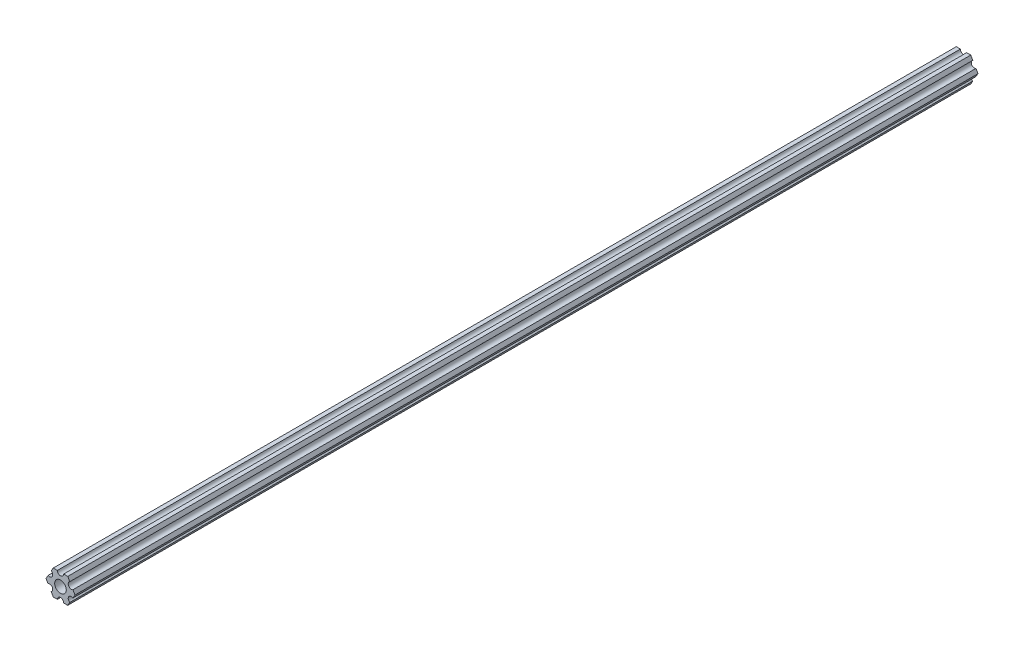
ISO-10303-21;
HEADER;
FILE_DESCRIPTION(('STEP AP214'),'2;1');
FILE_NAME('part.step','',(''),(''),'','','');
FILE_SCHEMA(('AUTOMOTIVE_DESIGN { 1 0 10303 214 1 1 1 1 }'));
ENDSEC;
DATA;
#1=APPLICATION_CONTEXT('core data for automotive mechanical design processes');
#2=APPLICATION_PROTOCOL_DEFINITION('international standard','automotive_design',2000,#1);
#3=PRODUCT_CONTEXT('',#1,'mechanical');
#4=PRODUCT('Part','Part','',(#3));
#5=PRODUCT_RELATED_PRODUCT_CATEGORY('part','',(#4));
#6=PRODUCT_DEFINITION_FORMATION('','',#4);
#7=PRODUCT_DEFINITION_CONTEXT('part definition',#1,'design');
#8=PRODUCT_DEFINITION('design','',#6,#7);
#9=PRODUCT_DEFINITION_SHAPE('','',#8);
#10=(LENGTH_UNIT() NAMED_UNIT(*) SI_UNIT(.MILLI.,.METRE.));
#11=(NAMED_UNIT(*) PLANE_ANGLE_UNIT() SI_UNIT($,.RADIAN.));
#12=(NAMED_UNIT(*) SI_UNIT($,.STERADIAN.) SOLID_ANGLE_UNIT());
#13=UNCERTAINTY_MEASURE_WITH_UNIT(LENGTH_MEASURE(1.E-05),#10,'distance_accuracy_value','');
#14=(GEOMETRIC_REPRESENTATION_CONTEXT(3) GLOBAL_UNCERTAINTY_ASSIGNED_CONTEXT((#13)) GLOBAL_UNIT_ASSIGNED_CONTEXT((#10,
#11,#12)) REPRESENTATION_CONTEXT('',''));
#15=CARTESIAN_POINT('',(0.,0.,0.));
#16=DIRECTION('',(0.,0.,1.));
#17=DIRECTION('',(1.,0.,0.));
#18=AXIS2_PLACEMENT_3D('',#15,#16,#17);
#19=CARTESIAN_POINT('',(3.66617459405346,-6.34999977789375,304.8));
#20=DIRECTION('',(-0.86602543407573,0.499999947533941,0.));
#21=DIRECTION('',(0.,0.,1.));
#22=AXIS2_PLACEMENT_3D('',#19,#20,#21);
#23=PLANE('',#22);
#24=DIRECTION('',(0.499999947533941,0.86602543407573,0.));
#25=VECTOR('',#24,1.);
#26=CARTESIAN_POINT('',(3.66617459405346,-6.34999977789375,0.));
#27=LINE('',#26,#25);
#28=CARTESIAN_POINT('',(3.66617459405346,-6.34999977789375,0.));
#29=VERTEX_POINT('',#28);
#30=CARTESIAN_POINT('',(4.70551158967065,-4.54981504343587,0.));
#31=VERTEX_POINT('',#30);
#32=EDGE_CURVE('E213',#29,#31,#27,.T.);
#33=ORIENTED_EDGE('',*,*,#32,.T.);
#34=DIRECTION('',(0.,0.,-1.));
#35=VECTOR('',#34,1.);
#36=CARTESIAN_POINT('',(4.70551158967065,-4.54981504343587,304.8));
#37=LINE('',#36,#35);
#38=CARTESIAN_POINT('',(4.70551169873047,-4.54981510640161,457.2));
#39=VERTEX_POINT('',#38);
#40=EDGE_CURVE('E11',#39,#31,#37,.T.);
#41=ORIENTED_EDGE('',*,*,#40,.F.);
#42=DIRECTION('',(0.500000000000004,0.866025403784436,0.));
#43=VECTOR('',#42,1.);
#44=CARTESIAN_POINT('',(4.70551169873047,-4.54981510640161,457.2));
#45=LINE('',#44,#43);
#46=CARTESIAN_POINT('',(3.66617459405343,-6.34999977789377,457.2));
#47=VERTEX_POINT('',#46);
#48=EDGE_CURVE('E362',#47,#39,#45,.T.);
#49=ORIENTED_EDGE('',*,*,#48,.F.);
#50=DIRECTION('',(0.,0.,-1.));
#51=VECTOR('',#50,1.);
#52=CARTESIAN_POINT('',(3.66617459405346,-6.34999977789375,304.8));
#53=LINE('',#52,#51);
#54=EDGE_CURVE('E53',#47,#29,#53,.T.);
#55=ORIENTED_EDGE('',*,*,#54,.T.);
#56=EDGE_LOOP('',(#33,#41,#49,#55));
#57=FACE_BOUND('',#56,.T.);
#58=ADVANCED_FACE('F42',(#57),#23,.F.);
#59=CARTESIAN_POINT('',(1.58750038469926,-6.34999990382518,304.8));
#60=DIRECTION('',(-6.05825721258438E-08,1.,0.));
#61=DIRECTION('',(0.,0.,1.));
#62=AXIS2_PLACEMENT_3D('',#59,#60,#61);
#63=PLANE('',#62);
#64=DIRECTION('',(1.,6.05825721258438E-08,0.));
#65=VECTOR('',#64,1.);
#66=CARTESIAN_POINT('',(1.58750038469926,-6.34999990382518,0.));
#67=LINE('',#66,#65);
#68=CARTESIAN_POINT('',(1.58750038469926,-6.34999990382518,0.));
#69=VERTEX_POINT('',#68);
#70=EDGE_CURVE('E209',#69,#29,#67,.T.);
#71=ORIENTED_EDGE('',*,*,#70,.T.);
#72=ORIENTED_EDGE('',*,*,#54,.F.);
#73=DIRECTION('',(0.999999999999998,6.05825725431102E-08,0.));
#74=VECTOR('',#73,1.);
#75=CARTESIAN_POINT('',(3.66617459405343,-6.34999977789377,457.2));
#76=LINE('',#75,#74);
#77=CARTESIAN_POINT('',(1.58750038469922,-6.3499999038252,457.2));
#78=VERTEX_POINT('',#77);
#79=EDGE_CURVE('E365',#78,#47,#76,.T.);
#80=ORIENTED_EDGE('',*,*,#79,.F.);
#81=DIRECTION('',(0.,0.,-1.));
#82=VECTOR('',#81,1.);
#83=CARTESIAN_POINT('',(1.58750038469926,-6.34999990382518,304.8));
#84=LINE('',#83,#82);
#85=EDGE_CURVE('E217',#78,#69,#84,.T.);
#86=ORIENTED_EDGE('',*,*,#85,.T.);
#87=EDGE_LOOP('',(#71,#72,#80,#86));
#88=FACE_BOUND('',#87,.T.);
#89=ADVANCED_FACE('F403',(#88),#63,.F.);
#90=CARTESIAN_POINT('',(3.8469926204343E-07,-6.35,304.8));
#91=DIRECTION('',(0.,0.,-1.));
#92=DIRECTION('',(-1.,0.,0.));
#93=AXIS2_PLACEMENT_3D('',#90,#91,#92);
#94=CYLINDRICAL_SURFACE('',#93,1.5875);
#95=CARTESIAN_POINT('',(3.8469926204343E-07,-6.35,0.));
#96=DIRECTION('',(0.,0.,-1.));
#97=DIRECTION('',(1.,0.,0.));
#98=AXIS2_PLACEMENT_3D('',#95,#96,#97);
#99=CIRCLE('',#98,1.5875);
#100=CARTESIAN_POINT('',(-1.58749961530073,-6.35000009617482,0.));
#101=VERTEX_POINT('',#100);
#102=EDGE_CURVE('E196',#101,#69,#99,.T.);
#103=ORIENTED_EDGE('',*,*,#102,.T.);
#104=ORIENTED_EDGE('',*,*,#85,.F.);
#105=CARTESIAN_POINT('',(3.8469921571851E-07,-6.35,457.2));
#106=DIRECTION('',(0.,0.,-1.));
#107=DIRECTION('',(1.,0.,0.));
#108=AXIS2_PLACEMENT_3D('',#105,#106,#107);
#109=CIRCLE('',#108,1.5875);
#110=CARTESIAN_POINT('',(-1.58749961530077,-6.35000022210626,457.2));
#111=VERTEX_POINT('',#110);
#112=EDGE_CURVE('E368',#111,#78,#109,.T.);
#113=ORIENTED_EDGE('',*,*,#112,.F.);
#114=DIRECTION('',(0.,0.,-1.));
#115=VECTOR('',#114,1.);
#116=CARTESIAN_POINT('',(-1.58749961530073,-6.35000009617482,304.8));
#117=LINE('',#116,#115);
#118=EDGE_CURVE('E214',#111,#101,#117,.T.);
#119=ORIENTED_EDGE('',*,*,#118,.T.);
#120=EDGE_LOOP('',(#103,#104,#113,#119));
#121=FACE_BOUND('',#120,.T.);
#122=ADVANCED_FACE('F409',(#121),#94,.F.);
#123=CARTESIAN_POINT('',(-3.66617382465481,-6.35000022210628,304.8));
#124=DIRECTION('',(-6.05825854783851E-08,1.,0.));
#125=DIRECTION('',(0.,0.,1.));
#126=AXIS2_PLACEMENT_3D('',#123,#124,#125);
#127=PLANE('',#126);
#128=DIRECTION('',(1.,6.05825854783851E-08,0.));
#129=VECTOR('',#128,1.);
#130=CARTESIAN_POINT('',(-3.66617382465481,-6.35000022210628,0.));
#131=LINE('',#130,#129);
#132=CARTESIAN_POINT('',(-3.66617382465481,-6.35000022210628,0.));
#133=VERTEX_POINT('',#132);
#134=EDGE_CURVE('E189',#133,#101,#131,.T.);
#135=ORIENTED_EDGE('',*,*,#134,.T.);
#136=ORIENTED_EDGE('',*,*,#118,.F.);
#137=DIRECTION('',(1.,0.,0.));
#138=VECTOR('',#137,1.);
#139=CARTESIAN_POINT('',(-1.58749961530077,-6.35000022210626,457.2));
#140=LINE('',#139,#138);
#141=CARTESIAN_POINT('',(-3.66617382465485,-6.35000022210624,457.2));
#142=VERTEX_POINT('',#141);
#143=EDGE_CURVE('E371',#142,#111,#140,.T.);
#144=ORIENTED_EDGE('',*,*,#143,.F.);
#145=DIRECTION('',(0.,0.,-1.));
#146=VECTOR('',#145,1.);
#147=CARTESIAN_POINT('',(-3.66617382465481,-6.35000022210628,304.8));
#148=LINE('',#147,#146);
#149=EDGE_CURVE('E172',#142,#133,#148,.T.);
#150=ORIENTED_EDGE('',*,*,#149,.T.);
#151=EDGE_LOOP('',(#135,#136,#144,#150));
#152=FACE_BOUND('',#151,.T.);
#153=ADVANCED_FACE('F418',(#152),#127,.F.);
#154=CARTESIAN_POINT('',(-4.70551103839172,-4.54981561357972,304.8));
#155=DIRECTION('',(0.866025373493152,0.500000052466045,0.));
#156=DIRECTION('',(0.,0.,-1.));
#157=AXIS2_PLACEMENT_3D('',#154,#155,#156);
#158=PLANE('',#157);
#159=DIRECTION('',(0.500000052466045,-0.866025373493152,0.));
#160=VECTOR('',#159,1.);
#161=CARTESIAN_POINT('',(-4.70551103839172,-4.54981561357972,0.));
#162=LINE('',#161,#160);
#163=CARTESIAN_POINT('',(-4.70551103839172,-4.54981561357972,0.));
#164=VERTEX_POINT('',#163);
#165=EDGE_CURVE('E163',#164,#133,#162,.T.);
#166=ORIENTED_EDGE('',*,*,#165,.T.);
#167=ORIENTED_EDGE('',*,*,#149,.F.);
#168=DIRECTION('',(0.500000052466044,-0.866025373493152,0.));
#169=VECTOR('',#168,1.);
#170=CARTESIAN_POINT('',(-3.66617382465485,-6.35000022210624,457.2));
#171=LINE('',#170,#169);
#172=CARTESIAN_POINT('',(-4.70551103839177,-4.54981561357968,457.2));
#173=VERTEX_POINT('',#172);
#174=EDGE_CURVE('E167',#173,#142,#171,.T.);
#175=ORIENTED_EDGE('',*,*,#174,.F.);
#176=DIRECTION('',(0.,0.,-1.));
#177=VECTOR('',#176,1.);
#178=CARTESIAN_POINT('',(-4.70551103839172,-4.54981561357972,304.8));
#179=LINE('',#178,#177);
#180=EDGE_CURVE('E159',#173,#164,#179,.T.);
#181=ORIENTED_EDGE('',*,*,#180,.T.);
#182=EDGE_LOOP('',(#166,#167,#175,#181));
#183=FACE_BOUND('',#182,.T.);
#184=ADVANCED_FACE('F44',(#183),#158,.F.);
#185=CARTESIAN_POINT('',(-5.49926112168156,-3.17500033315934,304.8));
#186=DIRECTION('',(0.,0.,-1.));
#187=DIRECTION('',(-1.,0.,0.));
#188=AXIS2_PLACEMENT_3D('',#185,#186,#187);
#189=CYLINDRICAL_SURFACE('',#188,1.5875);
#190=CARTESIAN_POINT('',(-5.49926112168156,-3.17500033315934,0.));
#191=DIRECTION('',(0.,0.,-1.));
#192=DIRECTION('',(1.,0.,0.));
#193=AXIS2_PLACEMENT_3D('',#190,#191,#192);
#194=CIRCLE('',#193,1.5875);
#195=CARTESIAN_POINT('',(-6.29301120497141,-1.80018505273897,0.));
#196=VERTEX_POINT('',#195);
#197=EDGE_CURVE('E176',#196,#164,#194,.T.);
#198=ORIENTED_EDGE('',*,*,#197,.T.);
#199=ORIENTED_EDGE('',*,*,#180,.F.);
#200=CARTESIAN_POINT('',(-5.49926112168158,-3.17500033315928,457.2));
#201=DIRECTION('',(0.,0.,-1.));
#202=DIRECTION('',(1.,0.,0.));
#203=AXIS2_PLACEMENT_3D('',#200,#201,#202);
#204=CIRCLE('',#203,1.5875);
#205=CARTESIAN_POINT('',(-6.29301131403124,-1.80018511570462,457.2));
#206=VERTEX_POINT('',#205);
#207=EDGE_CURVE('E375',#206,#173,#204,.T.);
#208=ORIENTED_EDGE('',*,*,#207,.F.);
#209=DIRECTION('',(0.,0.,-1.));
#210=VECTOR('',#209,1.);
#211=CARTESIAN_POINT('',(-6.29301120497141,-1.80018505273897,304.8));
#212=LINE('',#211,#210);
#213=EDGE_CURVE('E173',#206,#196,#212,.T.);
#214=ORIENTED_EDGE('',*,*,#213,.T.);
#215=EDGE_LOOP('',(#198,#199,#208,#214));
#216=FACE_BOUND('',#215,.T.);
#217=ADVANCED_FACE('F177',(#216),#189,.F.);
#218=CARTESIAN_POINT('',(-7.33234841870827,-4.44212523790841E-07,304.8));
#219=DIRECTION('',(0.866025373493151,0.500000052466045,0.));
#220=DIRECTION('',(0.,0.,-1.));
#221=AXIS2_PLACEMENT_3D('',#218,#219,#220);
#222=PLANE('',#221);
#223=DIRECTION('',(0.500000052466045,-0.866025373493151,0.));
#224=VECTOR('',#223,1.);
#225=CARTESIAN_POINT('',(-7.33234841870827,-4.44212523790841E-07,0.));
#226=LINE('',#225,#224);
#227=CARTESIAN_POINT('',(-7.33234841870827,-4.44212523790841E-07,0.));
#228=VERTEX_POINT('',#227);
#229=EDGE_CURVE('E183',#228,#196,#226,.T.);
#230=ORIENTED_EDGE('',*,*,#229,.T.);
#231=ORIENTED_EDGE('',*,*,#213,.F.);
#232=DIRECTION('',(0.500000000000031,-0.866025403784421,0.));
#233=VECTOR('',#232,1.);
#234=CARTESIAN_POINT('',(-6.29301131403124,-1.80018511570462,457.2));
#235=LINE('',#234,#233);
#236=CARTESIAN_POINT('',(-7.33234841870826,-4.44212631346432E-07,457.2));
#237=VERTEX_POINT('',#236);
#238=EDGE_CURVE('E377',#237,#206,#235,.T.);
#239=ORIENTED_EDGE('',*,*,#238,.F.);
#240=DIRECTION('',(0.,0.,-1.));
#241=VECTOR('',#240,1.);
#242=CARTESIAN_POINT('',(-7.33234841870827,-4.44212523790841E-07,304.8));
#243=LINE('',#242,#241);
#244=EDGE_CURVE('E230',#237,#228,#243,.T.);
#245=ORIENTED_EDGE('',*,*,#244,.T.);
#246=EDGE_LOOP('',(#230,#231,#239,#245));
#247=FACE_BOUND('',#246,.T.);
#248=ADVANCED_FACE('F434',(#247),#222,.F.);
#249=CARTESIAN_POINT('',(-6.29301142309098,1.80018429024547,304.8));
#250=DIRECTION('',(0.866025434075724,-0.499999947533952,0.));
#251=DIRECTION('',(0.,0.,-1.));
#252=AXIS2_PLACEMENT_3D('',#249,#250,#251);
#253=PLANE('',#252);
#254=DIRECTION('',(-0.499999947533951,-0.866025434075724,0.));
#255=VECTOR('',#254,1.);
#256=CARTESIAN_POINT('',(-6.29301142309098,1.80018429024547,0.));
#257=LINE('',#256,#255);
#258=CARTESIAN_POINT('',(-6.29301142309098,1.80018429024547,0.));
#259=VERTEX_POINT('',#258);
#260=EDGE_CURVE('E200',#259,#228,#257,.T.);
#261=ORIENTED_EDGE('',*,*,#260,.T.);
#262=ORIENTED_EDGE('',*,*,#244,.F.);
#263=DIRECTION('',(-0.499999947533919,-0.866025434075743,0.));
#264=VECTOR('',#263,1.);
#265=CARTESIAN_POINT('',(-7.33234841870826,-4.44212631346432E-07,457.2));
#266=LINE('',#265,#264);
#267=CARTESIAN_POINT('',(-6.29301142309097,1.80018429024554,457.2));
#268=VERTEX_POINT('',#267);
#269=EDGE_CURVE('E380',#268,#237,#266,.T.);
#270=ORIENTED_EDGE('',*,*,#269,.F.);
#271=DIRECTION('',(0.,0.,-1.));
#272=VECTOR('',#271,1.);
#273=CARTESIAN_POINT('',(-6.29301142309098,1.80018429024547,304.8));
#274=LINE('',#273,#272);
#275=EDGE_CURVE('E234',#268,#259,#274,.T.);
#276=ORIENTED_EDGE('',*,*,#275,.T.);
#277=EDGE_LOOP('',(#261,#262,#270,#276));
#278=FACE_BOUND('',#277,.T.);
#279=ADVANCED_FACE('F424',(#278),#253,.F.);
#280=CARTESIAN_POINT('',(-5.49926150638082,3.17499966684067,304.8));
#281=DIRECTION('',(0.,0.,-1.));
#282=DIRECTION('',(-1.,0.,0.));
#283=AXIS2_PLACEMENT_3D('',#280,#281,#282);
#284=CYLINDRICAL_SURFACE('',#283,1.5875);
#285=CARTESIAN_POINT('',(-5.49926150638082,3.17499966684067,0.));
#286=DIRECTION('',(0.,0.,-1.));
#287=DIRECTION('',(1.,0.,0.));
#288=AXIS2_PLACEMENT_3D('',#285,#286,#287);
#289=CIRCLE('',#288,1.5875);
#290=CARTESIAN_POINT('',(-4.70551158967065,4.54981504343587,0.));
#291=VERTEX_POINT('',#290);
#292=EDGE_CURVE('E281',#291,#259,#289,.T.);
#293=ORIENTED_EDGE('',*,*,#292,.T.);
#294=ORIENTED_EDGE('',*,*,#275,.F.);
#295=CARTESIAN_POINT('',(-5.49926150638078,3.17499966684073,457.2));
#296=DIRECTION('',(0.,0.,-1.));
#297=DIRECTION('',(1.,0.,0.));
#298=AXIS2_PLACEMENT_3D('',#295,#296,#297);
#299=CIRCLE('',#298,1.5875);
#300=CARTESIAN_POINT('',(-4.70551169873044,4.54981510640164,457.2));
#301=VERTEX_POINT('',#300);
#302=EDGE_CURVE('E383',#301,#268,#299,.T.);
#303=ORIENTED_EDGE('',*,*,#302,.F.);
#304=DIRECTION('',(0.,0.,-1.));
#305=VECTOR('',#304,1.);
#306=CARTESIAN_POINT('',(-4.70551158967065,4.54981504343587,304.8));
#307=LINE('',#306,#305);
#308=EDGE_CURVE('E208',#301,#291,#307,.T.);
#309=ORIENTED_EDGE('',*,*,#308,.T.);
#310=EDGE_LOOP('',(#293,#294,#303,#309));
#311=FACE_BOUND('',#310,.T.);
#312=ADVANCED_FACE('F420',(#311),#284,.F.);
#313=CARTESIAN_POINT('',(-3.66617459405349,6.3499997778937,304.8));
#314=DIRECTION('',(0.866025434075729,-0.499999947533942,0.));
#315=DIRECTION('',(0.,0.,-1.));
#316=AXIS2_PLACEMENT_3D('',#313,#314,#315);
#317=PLANE('',#316);
#318=DIRECTION('',(-0.499999947533943,-0.866025434075729,0.));
#319=VECTOR('',#318,1.);
#320=CARTESIAN_POINT('',(-3.66617459405349,6.3499997778937,0.));
#321=LINE('',#320,#319);
#322=CARTESIAN_POINT('',(-3.66617459405349,6.3499997778937,0.));
#323=VERTEX_POINT('',#322);
#324=EDGE_CURVE('E285',#323,#291,#321,.T.);
#325=ORIENTED_EDGE('',*,*,#324,.T.);
#326=ORIENTED_EDGE('',*,*,#308,.F.);
#327=DIRECTION('',(-0.499999999999992,-0.866025403784443,0.));
#328=VECTOR('',#327,1.);
#329=CARTESIAN_POINT('',(-4.70551169873044,4.54981510640164,457.2));
#330=LINE('',#329,#328);
#331=CARTESIAN_POINT('',(-3.66617459405349,6.3499997778937,457.2));
#332=VERTEX_POINT('',#331);
#333=EDGE_CURVE('E386',#332,#301,#330,.T.);
#334=ORIENTED_EDGE('',*,*,#333,.F.);
#335=DIRECTION('',(0.,0.,-1.));
#336=VECTOR('',#335,1.);
#337=CARTESIAN_POINT('',(-3.66617459405349,6.3499997778937,304.8));
#338=LINE('',#337,#336);
#339=EDGE_CURVE('E118',#332,#323,#338,.T.);
#340=ORIENTED_EDGE('',*,*,#339,.T.);
#341=EDGE_LOOP('',(#325,#326,#334,#340));
#342=FACE_BOUND('',#341,.T.);
#343=ADVANCED_FACE('F423',(#342),#317,.F.);
#344=CARTESIAN_POINT('',(-1.58750038469926,6.34999990382518,304.8));
#345=DIRECTION('',(6.05825963273174E-08,-1.,0.));
#346=DIRECTION('',(0.,0.,-1.));
#347=AXIS2_PLACEMENT_3D('',#344,#345,#346);
#348=PLANE('',#347);
#349=DIRECTION('',(-1.,-6.05825963273174E-08,0.));
#350=VECTOR('',#349,1.);
#351=CARTESIAN_POINT('',(-1.58750038469926,6.34999990382518,0.));
#352=LINE('',#351,#350);
#353=CARTESIAN_POINT('',(-1.58750038469926,6.34999990382519,0.));
#354=VERTEX_POINT('',#353);
#355=EDGE_CURVE('E250',#354,#323,#352,.T.);
#356=ORIENTED_EDGE('',*,*,#355,.T.);
#357=ORIENTED_EDGE('',*,*,#339,.F.);
#358=DIRECTION('',(-0.999999999999998,-6.05826013345191E-08,0.));
#359=VECTOR('',#358,1.);
#360=CARTESIAN_POINT('',(-3.66617459405349,6.3499997778937,457.2));
#361=LINE('',#360,#359);
#362=CARTESIAN_POINT('',(-1.58750038469926,6.34999990382519,457.2));
#363=VERTEX_POINT('',#362);
#364=EDGE_CURVE('E331',#363,#332,#361,.T.);
#365=ORIENTED_EDGE('',*,*,#364,.F.);
#366=DIRECTION('',(0.,0.,-1.));
#367=VECTOR('',#366,1.);
#368=CARTESIAN_POINT('',(-1.58750038469926,6.34999990382519,304.8));
#369=LINE('',#368,#367);
#370=EDGE_CURVE('E105',#363,#354,#369,.T.);
#371=ORIENTED_EDGE('',*,*,#370,.T.);
#372=EDGE_LOOP('',(#356,#357,#365,#371));
#373=FACE_BOUND('',#372,.T.);
#374=ADVANCED_FACE('F430',(#373),#348,.F.);
#375=CARTESIAN_POINT('',(-3.84699260060323E-07,6.35,304.8));
#376=DIRECTION('',(0.,0.,-1.));
#377=DIRECTION('',(-1.,0.,0.));
#378=AXIS2_PLACEMENT_3D('',#375,#376,#377);
#379=CYLINDRICAL_SURFACE('',#378,1.5875);
#380=CARTESIAN_POINT('',(-3.84699260060323E-07,6.35,0.));
#381=DIRECTION('',(0.,0.,-1.));
#382=DIRECTION('',(1.,0.,0.));
#383=AXIS2_PLACEMENT_3D('',#380,#381,#382);
#384=CIRCLE('',#383,1.5875);
#385=CARTESIAN_POINT('',(1.58749961530074,6.35000009617482,0.));
#386=VERTEX_POINT('',#385);
#387=EDGE_CURVE('E246',#386,#354,#384,.T.);
#388=ORIENTED_EDGE('',*,*,#387,.T.);
#389=ORIENTED_EDGE('',*,*,#370,.F.);
#390=CARTESIAN_POINT('',(-3.84699260060323E-07,6.35,457.2));
#391=DIRECTION('',(0.,0.,-1.));
#392=DIRECTION('',(1.,0.,0.));
#393=AXIS2_PLACEMENT_3D('',#390,#391,#392);
#394=CIRCLE('',#393,1.5875);
#395=CARTESIAN_POINT('',(1.58749961530073,6.35000022210627,457.2));
#396=VERTEX_POINT('',#395);
#397=EDGE_CURVE('E337',#396,#363,#394,.T.);
#398=ORIENTED_EDGE('',*,*,#397,.F.);
#399=DIRECTION('',(0.,0.,-1.));
#400=VECTOR('',#399,1.);
#401=CARTESIAN_POINT('',(1.58749961530074,6.35000009617482,304.8));
#402=LINE('',#401,#400);
#403=EDGE_CURVE('E220',#396,#386,#402,.T.);
#404=ORIENTED_EDGE('',*,*,#403,.T.);
#405=EDGE_LOOP('',(#388,#389,#398,#404));
#406=FACE_BOUND('',#405,.T.);
#407=ADVANCED_FACE('F426',(#406),#379,.F.);
#408=CARTESIAN_POINT('',(3.66617382465481,6.35000022210627,304.8));
#409=DIRECTION('',(6.05825850611185E-08,-1.,0.));
#410=DIRECTION('',(0.,0.,-1.));
#411=AXIS2_PLACEMENT_3D('',#408,#409,#410);
#412=PLANE('',#411);
#413=DIRECTION('',(-1.,-6.05825850611185E-08,0.));
#414=VECTOR('',#413,1.);
#415=CARTESIAN_POINT('',(3.66617382465481,6.35000022210627,0.));
#416=LINE('',#415,#414);
#417=CARTESIAN_POINT('',(3.66617382465481,6.35000022210627,0.));
#418=VERTEX_POINT('',#417);
#419=EDGE_CURVE('E249',#418,#386,#416,.T.);
#420=ORIENTED_EDGE('',*,*,#419,.T.);
#421=ORIENTED_EDGE('',*,*,#403,.F.);
#422=DIRECTION('',(-1.,0.,0.));
#423=VECTOR('',#422,1.);
#424=CARTESIAN_POINT('',(1.58749961530073,6.35000022210627,457.2));
#425=LINE('',#424,#423);
#426=CARTESIAN_POINT('',(3.66617382465481,6.35000022210627,457.2));
#427=VERTEX_POINT('',#426);
#428=EDGE_CURVE('E342',#427,#396,#425,.T.);
#429=ORIENTED_EDGE('',*,*,#428,.F.);
#430=DIRECTION('',(0.,0.,-1.));
#431=VECTOR('',#430,1.);
#432=CARTESIAN_POINT('',(3.66617382465481,6.35000022210627,304.8));
#433=LINE('',#432,#431);
#434=EDGE_CURVE('E257',#427,#418,#433,.T.);
#435=ORIENTED_EDGE('',*,*,#434,.T.);
#436=EDGE_LOOP('',(#420,#421,#429,#435));
#437=FACE_BOUND('',#436,.T.);
#438=ADVANCED_FACE('F429',(#437),#412,.F.);
#439=CARTESIAN_POINT('',(4.70551103839172,4.54981561357972,304.8));
#440=DIRECTION('',(-0.866025373493151,-0.500000052466046,0.));
#441=DIRECTION('',(-0.500000052466046,0.866025373493151,0.));
#442=AXIS2_PLACEMENT_3D('',#439,#440,#441);
#443=PLANE('',#442);
#444=DIRECTION('',(-0.500000052466046,0.866025373493151,0.));
#445=VECTOR('',#444,1.);
#446=CARTESIAN_POINT('',(4.70551103839172,4.54981561357972,0.));
#447=LINE('',#446,#445);
#448=CARTESIAN_POINT('',(4.70551103839172,4.54981561357972,0.));
#449=VERTEX_POINT('',#448);
#450=EDGE_CURVE('E261',#449,#418,#447,.T.);
#451=ORIENTED_EDGE('',*,*,#450,.T.);
#452=ORIENTED_EDGE('',*,*,#434,.F.);
#453=DIRECTION('',(-0.50000005246605,0.866025373493148,0.));
#454=VECTOR('',#453,1.);
#455=CARTESIAN_POINT('',(3.66617382465481,6.35000022210627,457.2));
#456=LINE('',#455,#454);
#457=CARTESIAN_POINT('',(4.70551103839174,4.54981561357971,457.2));
#458=VERTEX_POINT('',#457);
#459=EDGE_CURVE('E347',#458,#427,#456,.T.);
#460=ORIENTED_EDGE('',*,*,#459,.F.);
#461=DIRECTION('',(0.,0.,-1.));
#462=VECTOR('',#461,1.);
#463=CARTESIAN_POINT('',(4.70551103839172,4.54981561357972,304.8));
#464=LINE('',#463,#462);
#465=EDGE_CURVE('E221',#458,#449,#464,.T.);
#466=ORIENTED_EDGE('',*,*,#465,.T.);
#467=EDGE_LOOP('',(#451,#452,#460,#466));
#468=FACE_BOUND('',#467,.T.);
#469=ADVANCED_FACE('F450',(#468),#443,.F.);
#470=CARTESIAN_POINT('',(7.33234841870827,4.44212519169686E-07,304.8));
#471=DIRECTION('',(-0.866025373493145,-0.500000052466057,0.));
#472=DIRECTION('',(-0.500000052466057,0.866025373493145,0.));
#473=AXIS2_PLACEMENT_3D('',#470,#471,#472);
#474=PLANE('',#473);
#475=DIRECTION('',(-0.500000052466056,0.866025373493145,0.));
#476=VECTOR('',#475,1.);
#477=CARTESIAN_POINT('',(7.33234841870827,4.44212519169686E-07,0.));
#478=LINE('',#477,#476);
#479=CARTESIAN_POINT('',(7.33234841870827,4.44212519169686E-07,0.));
#480=VERTEX_POINT('',#479);
#481=CARTESIAN_POINT('',(6.29301120497139,1.80018505273894,0.));
#482=VERTEX_POINT('',#481);
#483=EDGE_CURVE('E205',#480,#482,#478,.T.);
#484=ORIENTED_EDGE('',*,*,#483,.T.);
#485=DIRECTION('',(0.,0.,-1.));
#486=VECTOR('',#485,1.);
#487=CARTESIAN_POINT('',(6.29301120497139,1.80018505273894,304.8));
#488=LINE('',#487,#486);
#489=CARTESIAN_POINT('',(6.29301131403122,1.80018511570467,457.2));
#490=VERTEX_POINT('',#489);
#491=EDGE_CURVE('E66',#490,#482,#488,.T.);
#492=ORIENTED_EDGE('',*,*,#491,.F.);
#493=DIRECTION('',(-0.499999999999998,0.86602540378444,0.));
#494=VECTOR('',#493,1.);
#495=CARTESIAN_POINT('',(6.29301131403122,1.80018511570467,457.2));
#496=LINE('',#495,#494);
#497=CARTESIAN_POINT('',(7.33234841870826,4.44212500550628E-07,457.2));
#498=VERTEX_POINT('',#497);
#499=EDGE_CURVE('E353',#498,#490,#496,.T.);
#500=ORIENTED_EDGE('',*,*,#499,.F.);
#501=DIRECTION('',(0.,0.,-1.));
#502=VECTOR('',#501,1.);
#503=CARTESIAN_POINT('',(7.33234841870827,4.44212519169686E-07,304.8));
#504=LINE('',#503,#502);
#505=EDGE_CURVE('E204',#498,#480,#504,.T.);
#506=ORIENTED_EDGE('',*,*,#505,.T.);
#507=EDGE_LOOP('',(#484,#492,#500,#506));
#508=FACE_BOUND('',#507,.T.);
#509=ADVANCED_FACE('F414',(#508),#474,.F.);
#510=CARTESIAN_POINT('',(6.29301142309098,-1.80018429024546,304.8));
#511=DIRECTION('',(-0.866025434075723,0.499999947533953,0.));
#512=DIRECTION('',(0.,0.,1.));
#513=AXIS2_PLACEMENT_3D('',#510,#511,#512);
#514=PLANE('',#513);
#515=DIRECTION('',(0.499999947533953,0.866025434075723,0.));
#516=VECTOR('',#515,1.);
#517=CARTESIAN_POINT('',(6.29301142309098,-1.80018429024546,0.));
#518=LINE('',#517,#516);
#519=CARTESIAN_POINT('',(6.29301142309098,-1.80018429024546,0.));
#520=VERTEX_POINT('',#519);
#521=EDGE_CURVE('E225',#520,#480,#518,.T.);
#522=ORIENTED_EDGE('',*,*,#521,.T.);
#523=ORIENTED_EDGE('',*,*,#505,.F.);
#524=DIRECTION('',(0.499999947533949,0.866025434075725,0.));
#525=VECTOR('',#524,1.);
#526=CARTESIAN_POINT('',(7.33234841870826,4.44212500550628E-07,457.2));
#527=LINE('',#526,#525);
#528=CARTESIAN_POINT('',(6.29301142309098,-1.8001842902455,457.2));
#529=VERTEX_POINT('',#528);
#530=EDGE_CURVE('E356',#529,#498,#527,.T.);
#531=ORIENTED_EDGE('',*,*,#530,.F.);
#532=DIRECTION('',(0.,0.,-1.));
#533=VECTOR('',#532,1.);
#534=CARTESIAN_POINT('',(6.29301142309098,-1.80018429024546,304.8));
#535=LINE('',#534,#533);
#536=EDGE_CURVE('E271',#529,#520,#535,.T.);
#537=ORIENTED_EDGE('',*,*,#536,.T.);
#538=EDGE_LOOP('',(#522,#523,#531,#537));
#539=FACE_BOUND('',#538,.T.);
#540=ADVANCED_FACE('F438',(#539),#514,.F.);
#541=CARTESIAN_POINT('',(5.49926112168156,3.17500033315934,0.));
#542=DIRECTION('',(0.,0.,1.));
#543=DIRECTION('',(1.,0.,0.));
#544=AXIS2_PLACEMENT_3D('',#541,#542,#543);
#545=PLANE('',#544);
#546=CARTESIAN_POINT('',(0.,0.,0.));
#547=DIRECTION('',(0.,0.,1.));
#548=DIRECTION('',(1.,0.,0.));
#549=AXIS2_PLACEMENT_3D('',#546,#547,#548);
#550=CIRCLE('',#549,2.9337);
#551=CARTESIAN_POINT('',(-2.9337,0.,0.));
#552=VERTEX_POINT('',#551);
#553=CARTESIAN_POINT('',(2.9337,0.,0.));
#554=VERTEX_POINT('',#553);
#555=EDGE_CURVE('E235',#552,#554,#550,.T.);
#556=ORIENTED_EDGE('',*,*,#555,.T.);
#557=CARTESIAN_POINT('',(0.,0.,0.));
#558=DIRECTION('',(0.,0.,1.));
#559=DIRECTION('',(1.,0.,0.));
#560=AXIS2_PLACEMENT_3D('',#557,#558,#559);
#561=CIRCLE('',#560,2.9337);
#562=EDGE_CURVE('E202',#554,#552,#561,.T.);
#563=ORIENTED_EDGE('',*,*,#562,.T.);
#564=EDGE_LOOP('',(#556,#563));
#565=FACE_BOUND('',#564,.T.);
#566=ORIENTED_EDGE('',*,*,#521,.F.);
#567=CARTESIAN_POINT('',(5.49926150638082,-3.17499966684067,0.));
#568=DIRECTION('',(0.,0.,-1.));
#569=DIRECTION('',(1.,0.,0.));
#570=AXIS2_PLACEMENT_3D('',#567,#568,#569);
#571=CIRCLE('',#570,1.5875);
#572=CARTESIAN_POINT('',(3.91176150638082,-3.17499966684067,0.));
#573=VERTEX_POINT('',#572);
#574=EDGE_CURVE('E275',#573,#520,#571,.T.);
#575=ORIENTED_EDGE('',*,*,#574,.F.);
#576=CARTESIAN_POINT('',(5.49926150638082,-3.17499966684067,0.));
#577=DIRECTION('',(0.,0.,-1.));
#578=DIRECTION('',(1.,0.,0.));
#579=AXIS2_PLACEMENT_3D('',#576,#577,#578);
#580=CIRCLE('',#579,1.5875);
#581=EDGE_CURVE('E269',#31,#573,#580,.T.);
#582=ORIENTED_EDGE('',*,*,#581,.F.);
#583=ORIENTED_EDGE('',*,*,#32,.F.);
#584=ORIENTED_EDGE('',*,*,#70,.F.);
#585=ORIENTED_EDGE('',*,*,#102,.F.);
#586=ORIENTED_EDGE('',*,*,#134,.F.);
#587=ORIENTED_EDGE('',*,*,#165,.F.);
#588=ORIENTED_EDGE('',*,*,#197,.F.);
#589=ORIENTED_EDGE('',*,*,#229,.F.);
#590=ORIENTED_EDGE('',*,*,#260,.F.);
#591=ORIENTED_EDGE('',*,*,#292,.F.);
#592=ORIENTED_EDGE('',*,*,#324,.F.);
#593=ORIENTED_EDGE('',*,*,#355,.F.);
#594=ORIENTED_EDGE('',*,*,#387,.F.);
#595=ORIENTED_EDGE('',*,*,#419,.F.);
#596=ORIENTED_EDGE('',*,*,#450,.F.);
#597=CARTESIAN_POINT('',(5.49926112168156,3.17500033315934,0.));
#598=DIRECTION('',(0.,0.,-1.));
#599=DIRECTION('',(1.,0.,0.));
#600=AXIS2_PLACEMENT_3D('',#597,#598,#599);
#601=CIRCLE('',#600,1.5875);
#602=CARTESIAN_POINT('',(3.91176112168156,3.17500033315934,0.));
#603=VERTEX_POINT('',#602);
#604=EDGE_CURVE('E226',#603,#449,#601,.T.);
#605=ORIENTED_EDGE('',*,*,#604,.F.);
#606=CARTESIAN_POINT('',(5.49926112168156,3.17500033315934,0.));
#607=DIRECTION('',(0.,0.,-1.));
#608=DIRECTION('',(1.,0.,0.));
#609=AXIS2_PLACEMENT_3D('',#606,#607,#608);
#610=CIRCLE('',#609,1.5875);
#611=EDGE_CURVE('E264',#482,#603,#610,.T.);
#612=ORIENTED_EDGE('',*,*,#611,.F.);
#613=ORIENTED_EDGE('',*,*,#483,.F.);
#614=EDGE_LOOP('',(#566,#575,#582,#583,#584,#585,#586,#587,#588,#589,#590,#591,#592,#593,#594,
#595,#596,#605,#612,#613));
#615=FACE_BOUND('',#614,.T.);
#616=ADVANCED_FACE('F186',(#565,#615),#545,.F.);
#617=CARTESIAN_POINT('',(5.49926112168156,3.17500033315934,304.8));
#618=DIRECTION('',(0.,0.,-1.));
#619=DIRECTION('',(-1.,0.,0.));
#620=AXIS2_PLACEMENT_3D('',#617,#618,#619);
#621=CYLINDRICAL_SURFACE('',#620,1.5875);
#622=ORIENTED_EDGE('',*,*,#465,.F.);
#623=CARTESIAN_POINT('',(5.49926112168156,3.17500033315932,457.2));
#624=DIRECTION('',(0.,0.,-1.));
#625=DIRECTION('',(1.,0.,0.));
#626=AXIS2_PLACEMENT_3D('',#623,#624,#625);
#627=CIRCLE('',#626,1.5875);
#628=EDGE_CURVE('E350',#490,#458,#627,.T.);
#629=ORIENTED_EDGE('',*,*,#628,.F.);
#630=ORIENTED_EDGE('',*,*,#491,.T.);
#631=ORIENTED_EDGE('',*,*,#611,.T.);
#632=DIRECTION('',(0.,0.,-1.));
#633=VECTOR('',#632,1.);
#634=CARTESIAN_POINT('',(3.91176112168156,3.17500033315934,304.8));
#635=LINE('',#634,#633);
#636=CARTESIAN_POINT('',(3.91176112168156,3.17500033315934,304.8));
#637=VERTEX_POINT('',#636);
#638=EDGE_CURVE('E254',#637,#603,#635,.T.);
#639=ORIENTED_EDGE('',*,*,#638,.F.);
#640=ORIENTED_EDGE('',*,*,#638,.T.);
#641=ORIENTED_EDGE('',*,*,#604,.T.);
#642=EDGE_LOOP('',(#622,#629,#630,#631,#639,#640,#641));
#643=FACE_BOUND('',#642,.T.);
#644=ADVANCED_FACE('F437',(#643),#621,.F.);
#645=CARTESIAN_POINT('',(5.49926150638082,-3.17499966684067,304.8));
#646=DIRECTION('',(0.,0.,-1.));
#647=DIRECTION('',(-1.,0.,0.));
#648=AXIS2_PLACEMENT_3D('',#645,#646,#647);
#649=CYLINDRICAL_SURFACE('',#648,1.5875);
#650=ORIENTED_EDGE('',*,*,#536,.F.);
#651=CARTESIAN_POINT('',(5.4992615063808,-3.17499966684069,457.2));
#652=DIRECTION('',(0.,0.,-1.));
#653=DIRECTION('',(1.,0.,0.));
#654=AXIS2_PLACEMENT_3D('',#651,#652,#653);
#655=CIRCLE('',#654,1.5875);
#656=EDGE_CURVE('E359',#39,#529,#655,.T.);
#657=ORIENTED_EDGE('',*,*,#656,.F.);
#658=ORIENTED_EDGE('',*,*,#40,.T.);
#659=ORIENTED_EDGE('',*,*,#581,.T.);
#660=DIRECTION('',(0.,0.,-1.));
#661=VECTOR('',#660,1.);
#662=CARTESIAN_POINT('',(3.91176150638082,-3.17499966684067,304.8));
#663=LINE('',#662,#661);
#664=CARTESIAN_POINT('',(3.91176150638082,-3.17499966684067,304.8));
#665=VERTEX_POINT('',#664);
#666=EDGE_CURVE('E306',#665,#573,#663,.T.);
#667=ORIENTED_EDGE('',*,*,#666,.F.);
#668=ORIENTED_EDGE('',*,*,#666,.T.);
#669=ORIENTED_EDGE('',*,*,#574,.T.);
#670=EDGE_LOOP('',(#650,#657,#658,#659,#667,#668,#669));
#671=FACE_BOUND('',#670,.T.);
#672=ADVANCED_FACE('F400',(#671),#649,.F.);
#673=CARTESIAN_POINT('',(0.,0.,304.8));
#674=DIRECTION('',(0.,0.,-1.));
#675=DIRECTION('',(-1.,0.,0.));
#676=AXIS2_PLACEMENT_3D('',#673,#674,#675);
#677=CYLINDRICAL_SURFACE('',#676,2.9337);
#678=DIRECTION('',(0.,0.,-1.));
#679=VECTOR('',#678,1.);
#680=CARTESIAN_POINT('',(-2.9337,0.,304.8));
#681=LINE('',#680,#679);
#682=CARTESIAN_POINT('',(-2.9337,0.,304.8));
#683=VERTEX_POINT('',#682);
#684=EDGE_CURVE('E239',#683,#552,#681,.T.);
#685=ORIENTED_EDGE('',*,*,#684,.F.);
#686=ORIENTED_EDGE('',*,*,#684,.T.);
#687=ORIENTED_EDGE('',*,*,#562,.F.);
#688=DIRECTION('',(0.,0.,-1.));
#689=VECTOR('',#688,1.);
#690=CARTESIAN_POINT('',(2.9337,0.,304.8));
#691=LINE('',#690,#689);
#692=CARTESIAN_POINT('',(2.9337,0.,304.8));
#693=VERTEX_POINT('',#692);
#694=EDGE_CURVE('E240',#693,#554,#691,.T.);
#695=ORIENTED_EDGE('',*,*,#694,.F.);
#696=ORIENTED_EDGE('',*,*,#694,.T.);
#697=ORIENTED_EDGE('',*,*,#555,.F.);
#698=EDGE_LOOP('',(#685,#686,#687,#695,#696,#697));
#699=FACE_BOUND('',#698,.T.);
#700=CARTESIAN_POINT('',(0.,0.,457.2));
#701=DIRECTION('',(0.,0.,1.));
#702=DIRECTION('',(1.,0.,0.));
#703=AXIS2_PLACEMENT_3D('',#700,#701,#702);
#704=CIRCLE('',#703,2.9337);
#705=CARTESIAN_POINT('',(2.9337,0.,457.2));
#706=VERTEX_POINT('',#705);
#707=EDGE_CURVE('E388',#706,#706,#704,.T.);
#708=ORIENTED_EDGE('',*,*,#707,.T.);
#709=EDGE_LOOP('',(#708));
#710=FACE_BOUND('',#709,.T.);
#711=ADVANCED_FACE('F392',(#699,#710),#677,.F.);
#712=CARTESIAN_POINT('',(-3.84699260060323E-07,6.35,457.2));
#713=DIRECTION('',(0.,0.,1.));
#714=DIRECTION('',(1.,0.,0.));
#715=AXIS2_PLACEMENT_3D('',#712,#713,#714);
#716=PLANE('',#715);
#717=ORIENTED_EDGE('',*,*,#333,.T.);
#718=ORIENTED_EDGE('',*,*,#302,.T.);
#719=ORIENTED_EDGE('',*,*,#269,.T.);
#720=ORIENTED_EDGE('',*,*,#238,.T.);
#721=ORIENTED_EDGE('',*,*,#207,.T.);
#722=ORIENTED_EDGE('',*,*,#174,.T.);
#723=ORIENTED_EDGE('',*,*,#143,.T.);
#724=ORIENTED_EDGE('',*,*,#112,.T.);
#725=ORIENTED_EDGE('',*,*,#79,.T.);
#726=ORIENTED_EDGE('',*,*,#48,.T.);
#727=ORIENTED_EDGE('',*,*,#656,.T.);
#728=ORIENTED_EDGE('',*,*,#530,.T.);
#729=ORIENTED_EDGE('',*,*,#499,.T.);
#730=ORIENTED_EDGE('',*,*,#628,.T.);
#731=ORIENTED_EDGE('',*,*,#459,.T.);
#732=ORIENTED_EDGE('',*,*,#428,.T.);
#733=ORIENTED_EDGE('',*,*,#397,.T.);
#734=ORIENTED_EDGE('',*,*,#364,.T.);
#735=EDGE_LOOP('',(#717,#718,#719,#720,#721,#722,#723,#724,#725,#726,#727,#728,#729,#730,#731,
#732,#733,#734));
#736=FACE_BOUND('',#735,.T.);
#737=ORIENTED_EDGE('',*,*,#707,.F.);
#738=EDGE_LOOP('',(#737));
#739=FACE_BOUND('',#738,.T.);
#740=ADVANCED_FACE('F394',(#736,#739),#716,.T.);
#741=CLOSED_SHELL('',(#58,#89,#122,#153,#184,#217,#248,#279,#312,#343,#374,#407,#438,#469,#509,
#540,#616,#644,#672,#711,#740));
#742=MANIFOLD_SOLID_BREP('B2',#741);
#743=ADVANCED_BREP_SHAPE_REPRESENTATION('',(#18,#742),#14);
#744=SHAPE_DEFINITION_REPRESENTATION(#9,#743);
ENDSEC;
END-ISO-10303-21;
